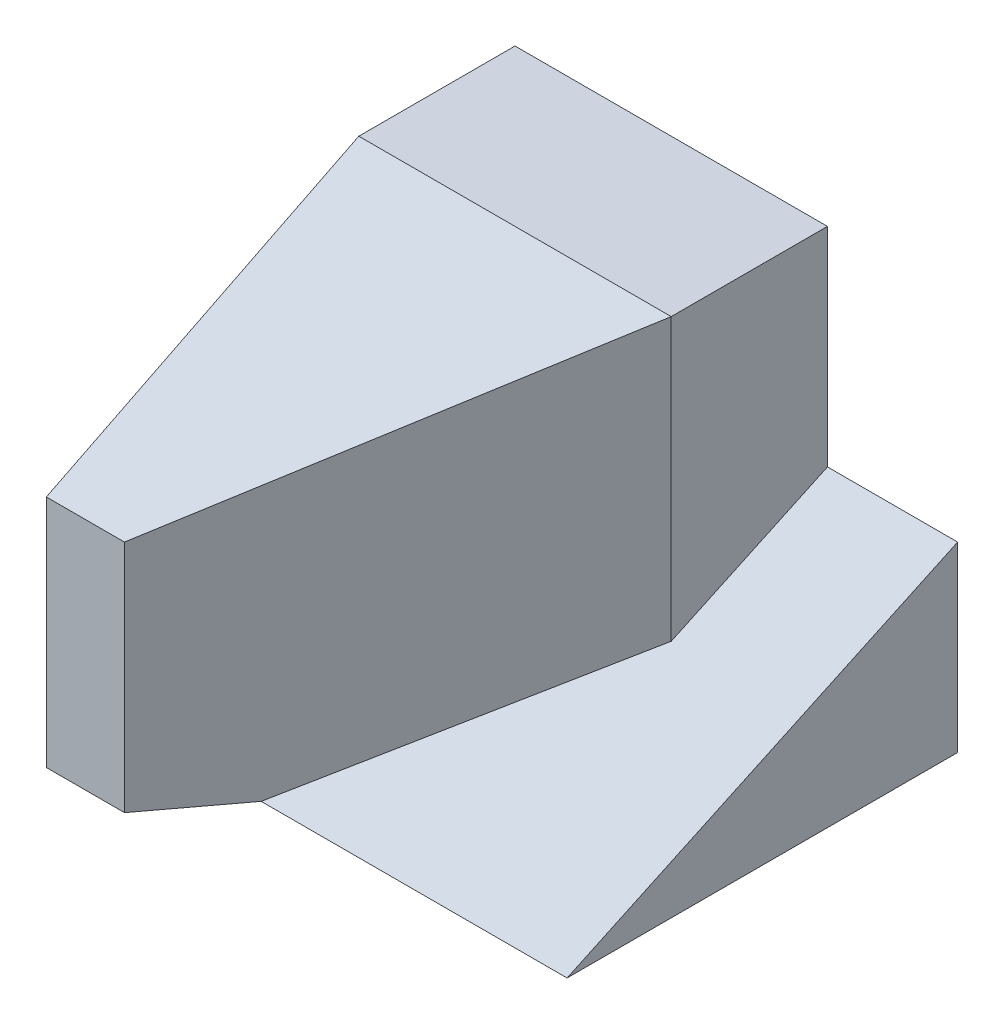
ISO-10303-21;
HEADER;
FILE_DESCRIPTION(('STEP AP214'),'2;1');
FILE_NAME('part.step','',(''),(''),'','','');
FILE_SCHEMA(('AUTOMOTIVE_DESIGN { 1 0 10303 214 1 1 1 1 }'));
ENDSEC;
DATA;
#1=APPLICATION_CONTEXT('core data for automotive mechanical design processes');
#2=APPLICATION_PROTOCOL_DEFINITION('international standard','automotive_design',2000,#1);
#3=PRODUCT_CONTEXT('',#1,'mechanical');
#4=PRODUCT('Part','Part','',(#3));
#5=PRODUCT_RELATED_PRODUCT_CATEGORY('part','',(#4));
#6=PRODUCT_DEFINITION_FORMATION('','',#4);
#7=PRODUCT_DEFINITION_CONTEXT('part definition',#1,'design');
#8=PRODUCT_DEFINITION('design','',#6,#7);
#9=PRODUCT_DEFINITION_SHAPE('','',#8);
#10=(LENGTH_UNIT() NAMED_UNIT(*) SI_UNIT(.MILLI.,.METRE.));
#11=(NAMED_UNIT(*) PLANE_ANGLE_UNIT() SI_UNIT($,.RADIAN.));
#12=(NAMED_UNIT(*) SI_UNIT($,.STERADIAN.) SOLID_ANGLE_UNIT());
#13=UNCERTAINTY_MEASURE_WITH_UNIT(LENGTH_MEASURE(1.E-05),#10,'distance_accuracy_value','');
#14=(GEOMETRIC_REPRESENTATION_CONTEXT(3) GLOBAL_UNCERTAINTY_ASSIGNED_CONTEXT((#13)) GLOBAL_UNIT_ASSIGNED_CONTEXT((#10,
#11,#12)) REPRESENTATION_CONTEXT('',''));
#15=CARTESIAN_POINT('',(0.,0.,0.));
#16=DIRECTION('',(0.,0.,1.));
#17=DIRECTION('',(1.,0.,0.));
#18=AXIS2_PLACEMENT_3D('',#15,#16,#17);
#19=CARTESIAN_POINT('',(0.,75.,0.));
#20=DIRECTION('',(1.,0.,0.));
#21=DIRECTION('',(0.,0.,-1.));
#22=AXIS2_PLACEMENT_3D('',#19,#20,#21);
#23=PLANE('',#22);
#24=DIRECTION('',(0.,-1.,0.));
#25=VECTOR('',#24,1.);
#26=CARTESIAN_POINT('',(0.,75.,0.));
#27=LINE('',#26,#25);
#28=CARTESIAN_POINT('',(0.,45.,0.));
#29=VERTEX_POINT('',#28);
#30=CARTESIAN_POINT('',(0.,0.,0.));
#31=VERTEX_POINT('',#30);
#32=EDGE_CURVE('E150',#29,#31,#27,.T.);
#33=ORIENTED_EDGE('',*,*,#32,.F.);
#34=DIRECTION('',(0.,0.447213595499958,-0.894427190999916));
#35=VECTOR('',#34,1.);
#36=CARTESIAN_POINT('',(0.,75.,-60.));
#37=LINE('',#36,#35);
#38=CARTESIAN_POINT('',(0.,75.,-60.));
#39=VERTEX_POINT('',#38);
#40=EDGE_CURVE('E121',#29,#39,#37,.T.);
#41=ORIENTED_EDGE('',*,*,#40,.T.);
#42=DIRECTION('',(0.,0.,1.));
#43=VECTOR('',#42,1.);
#44=CARTESIAN_POINT('',(0.,75.,0.));
#45=LINE('',#44,#43);
#46=CARTESIAN_POINT('',(0.,75.,-90.));
#47=VERTEX_POINT('',#46);
#48=EDGE_CURVE('E132',#47,#39,#45,.T.);
#49=ORIENTED_EDGE('',*,*,#48,.F.);
#50=DIRECTION('',(0.,-1.,0.));
#51=VECTOR('',#50,1.);
#52=CARTESIAN_POINT('',(0.,75.,-90.));
#53=LINE('',#52,#51);
#54=CARTESIAN_POINT('',(0.,0.,-90.));
#55=VERTEX_POINT('',#54);
#56=EDGE_CURVE('E140',#47,#55,#53,.T.);
#57=ORIENTED_EDGE('',*,*,#56,.T.);
#58=DIRECTION('',(0.,0.,1.));
#59=VECTOR('',#58,1.);
#60=CARTESIAN_POINT('',(0.,0.,0.));
#61=LINE('',#60,#59);
#62=EDGE_CURVE('E129',#55,#31,#61,.T.);
#63=ORIENTED_EDGE('',*,*,#62,.T.);
#64=EDGE_LOOP('',(#33,#41,#49,#57,#63));
#65=FACE_BOUND('',#64,.T.);
#66=ADVANCED_FACE('F31',(#65),#23,.F.);
#67=CARTESIAN_POINT('',(0.,75.,0.));
#68=DIRECTION('',(0.,0.,-1.));
#69=DIRECTION('',(-1.,0.,0.));
#70=AXIS2_PLACEMENT_3D('',#67,#68,#69);
#71=PLANE('',#70);
#72=DIRECTION('',(1.,0.,0.));
#73=VECTOR('',#72,1.);
#74=CARTESIAN_POINT('',(0.,0.,0.));
#75=LINE('',#74,#73);
#76=CARTESIAN_POINT('',(15.,0.,0.));
#77=VERTEX_POINT('',#76);
#78=EDGE_CURVE('E143',#31,#77,#75,.T.);
#79=ORIENTED_EDGE('',*,*,#78,.T.);
#80=DIRECTION('',(0.,1.,0.));
#81=VECTOR('',#80,1.);
#82=CARTESIAN_POINT('',(15.,0.,0.));
#83=LINE('',#82,#81);
#84=CARTESIAN_POINT('',(15.,45.,0.));
#85=VERTEX_POINT('',#84);
#86=EDGE_CURVE('E118',#77,#85,#83,.T.);
#87=ORIENTED_EDGE('',*,*,#86,.T.);
#88=DIRECTION('',(1.,0.,0.));
#89=VECTOR('',#88,1.);
#90=CARTESIAN_POINT('',(0.,45.,0.));
#91=LINE('',#90,#89);
#92=EDGE_CURVE('E125',#29,#85,#91,.T.);
#93=ORIENTED_EDGE('',*,*,#92,.F.);
#94=ORIENTED_EDGE('',*,*,#32,.T.);
#95=EDGE_LOOP('',(#79,#87,#93,#94));
#96=FACE_BOUND('',#95,.T.);
#97=ADVANCED_FACE('F166',(#96),#71,.F.);
#98=CARTESIAN_POINT('',(60.,75.,0.));
#99=DIRECTION('',(-1.,0.,0.));
#100=DIRECTION('',(0.,0.,1.));
#101=AXIS2_PLACEMENT_3D('',#98,#99,#100);
#102=PLANE('',#101);
#103=DIRECTION('',(0.,1.,0.));
#104=VECTOR('',#103,1.);
#105=CARTESIAN_POINT('',(60.,0.,-60.));
#106=LINE('',#105,#104);
#107=CARTESIAN_POINT('',(60.,21.,-60.));
#108=VERTEX_POINT('',#107);
#109=CARTESIAN_POINT('',(60.,75.,-60.));
#110=VERTEX_POINT('',#109);
#111=EDGE_CURVE('E51',#108,#110,#106,.T.);
#112=ORIENTED_EDGE('',*,*,#111,.F.);
#113=DIRECTION('',(0.,0.422885465331124,-0.906183139995265));
#114=VECTOR('',#113,1.);
#115=CARTESIAN_POINT('',(60.,7.66423357664234,-31.4233576642336));
#116=LINE('',#115,#114);
#117=CARTESIAN_POINT('',(60.,35.,-90.));
#118=VERTEX_POINT('',#117);
#119=EDGE_CURVE('E45',#108,#118,#116,.T.);
#120=ORIENTED_EDGE('',*,*,#119,.T.);
#121=DIRECTION('',(0.,-1.,0.));
#122=VECTOR('',#121,1.);
#123=CARTESIAN_POINT('',(60.,75.,-90.));
#124=LINE('',#123,#122);
#125=CARTESIAN_POINT('',(60.,75.,-90.));
#126=VERTEX_POINT('',#125);
#127=EDGE_CURVE('E98',#126,#118,#124,.T.);
#128=ORIENTED_EDGE('',*,*,#127,.F.);
#129=DIRECTION('',(0.,0.,-1.));
#130=VECTOR('',#129,1.);
#131=CARTESIAN_POINT('',(60.,75.,0.));
#132=LINE('',#131,#130);
#133=EDGE_CURVE('E135',#110,#126,#132,.T.);
#134=ORIENTED_EDGE('',*,*,#133,.F.);
#135=EDGE_LOOP('',(#112,#120,#128,#134));
#136=FACE_BOUND('',#135,.T.);
#137=ADVANCED_FACE('F160',(#136),#102,.F.);
#138=CARTESIAN_POINT('',(0.,75.,-90.));
#139=DIRECTION('',(0.,0.,1.));
#140=DIRECTION('',(1.,0.,0.));
#141=AXIS2_PLACEMENT_3D('',#138,#139,#140);
#142=PLANE('',#141);
#143=ORIENTED_EDGE('',*,*,#127,.T.);
#144=DIRECTION('',(1.,0.,0.));
#145=VECTOR('',#144,1.);
#146=CARTESIAN_POINT('',(5.,35.,-90.));
#147=LINE('',#146,#145);
#148=CARTESIAN_POINT('',(85.,35.,-90.));
#149=VERTEX_POINT('',#148);
#150=EDGE_CURVE('E91',#118,#149,#147,.T.);
#151=ORIENTED_EDGE('',*,*,#150,.T.);
#152=DIRECTION('',(0.,1.,0.));
#153=VECTOR('',#152,1.);
#154=CARTESIAN_POINT('',(85.,35.,-90.));
#155=LINE('',#154,#153);
#156=CARTESIAN_POINT('',(85.,0.,-90.));
#157=VERTEX_POINT('',#156);
#158=EDGE_CURVE('E95',#157,#149,#155,.T.);
#159=ORIENTED_EDGE('',*,*,#158,.F.);
#160=DIRECTION('',(-1.,0.,0.));
#161=VECTOR('',#160,1.);
#162=CARTESIAN_POINT('',(0.,0.,-90.));
#163=LINE('',#162,#161);
#164=EDGE_CURVE('E136',#157,#55,#163,.T.);
#165=ORIENTED_EDGE('',*,*,#164,.T.);
#166=ORIENTED_EDGE('',*,*,#56,.F.);
#167=DIRECTION('',(-1.,0.,0.));
#168=VECTOR('',#167,1.);
#169=CARTESIAN_POINT('',(0.,75.,-90.));
#170=LINE('',#169,#168);
#171=EDGE_CURVE('E138',#126,#47,#170,.T.);
#172=ORIENTED_EDGE('',*,*,#171,.F.);
#173=EDGE_LOOP('',(#143,#151,#159,#165,#166,#172));
#174=FACE_BOUND('',#173,.T.);
#175=ADVANCED_FACE('F93',(#174),#142,.F.);
#176=CARTESIAN_POINT('',(0.,75.,-90.));
#177=DIRECTION('',(0.,-1.,0.));
#178=DIRECTION('',(0.,0.,-1.));
#179=AXIS2_PLACEMENT_3D('',#176,#177,#178);
#180=PLANE('',#179);
#181=ORIENTED_EDGE('',*,*,#48,.T.);
#182=DIRECTION('',(1.,0.,0.));
#183=VECTOR('',#182,1.);
#184=CARTESIAN_POINT('',(0.,75.,-60.));
#185=LINE('',#184,#183);
#186=EDGE_CURVE('E126',#39,#110,#185,.T.);
#187=ORIENTED_EDGE('',*,*,#186,.T.);
#188=ORIENTED_EDGE('',*,*,#133,.T.);
#189=ORIENTED_EDGE('',*,*,#171,.T.);
#190=EDGE_LOOP('',(#181,#187,#188,#189));
#191=FACE_BOUND('',#190,.T.);
#192=ADVANCED_FACE('F157',(#191),#180,.F.);
#193=CARTESIAN_POINT('',(0.,0.,-90.));
#194=DIRECTION('',(0.,-1.,0.));
#195=DIRECTION('',(0.,0.,-1.));
#196=AXIS2_PLACEMENT_3D('',#193,#194,#195);
#197=PLANE('',#196);
#198=ORIENTED_EDGE('',*,*,#164,.F.);
#199=DIRECTION('',(0.,0.,-1.));
#200=VECTOR('',#199,1.);
#201=CARTESIAN_POINT('',(85.,0.,-90.));
#202=LINE('',#201,#200);
#203=CARTESIAN_POINT('',(85.,0.,-15.));
#204=VERTEX_POINT('',#203);
#205=EDGE_CURVE('E100',#204,#157,#202,.T.);
#206=ORIENTED_EDGE('',*,*,#205,.F.);
#207=DIRECTION('',(1.,0.,0.));
#208=VECTOR('',#207,1.);
#209=CARTESIAN_POINT('',(5.,0.,-15.));
#210=LINE('',#209,#208);
#211=CARTESIAN_POINT('',(26.25,0.,-15.));
#212=VERTEX_POINT('',#211);
#213=EDGE_CURVE('E99',#212,#204,#210,.T.);
#214=ORIENTED_EDGE('',*,*,#213,.F.);
#215=DIRECTION('',(-0.6,0.,0.8));
#216=VECTOR('',#215,1.);
#217=CARTESIAN_POINT('',(60.,0.,-60.));
#218=LINE('',#217,#216);
#219=EDGE_CURVE('E116',#212,#77,#218,.T.);
#220=ORIENTED_EDGE('',*,*,#219,.T.);
#221=ORIENTED_EDGE('',*,*,#78,.F.);
#222=ORIENTED_EDGE('',*,*,#62,.F.);
#223=EDGE_LOOP('',(#198,#206,#214,#220,#221,#222));
#224=FACE_BOUND('',#223,.T.);
#225=ADVANCED_FACE('F171',(#224),#197,.T.);
#226=CARTESIAN_POINT('',(0.,75.,-60.));
#227=DIRECTION('',(0.,-0.894427190999916,-0.447213595499958));
#228=DIRECTION('',(0.,0.447213595499958,-0.894427190999916));
#229=AXIS2_PLACEMENT_3D('',#226,#227,#228);
#230=PLANE('',#229);
#231=ORIENTED_EDGE('',*,*,#92,.T.);
#232=DIRECTION('',(0.557086014531155,0.371390676354104,-0.742781352708207));
#233=VECTOR('',#232,1.);
#234=CARTESIAN_POINT('',(41.3793103448276,62.5862068965517,-35.1724137931034));
#235=LINE('',#234,#233);
#236=EDGE_CURVE('E38',#85,#110,#235,.T.);
#237=ORIENTED_EDGE('',*,*,#236,.T.);
#238=ORIENTED_EDGE('',*,*,#186,.F.);
#239=ORIENTED_EDGE('',*,*,#40,.F.);
#240=EDGE_LOOP('',(#231,#237,#238,#239));
#241=FACE_BOUND('',#240,.T.);
#242=ADVANCED_FACE('F152',(#241),#230,.F.);
#243=CARTESIAN_POINT('',(60.,0.,-60.));
#244=DIRECTION('',(-0.8,0.,-0.6));
#245=DIRECTION('',(-0.6,0.,0.8));
#246=AXIS2_PLACEMENT_3D('',#243,#244,#245);
#247=PLANE('',#246);
#248=ORIENTED_EDGE('',*,*,#219,.F.);
#249=DIRECTION('',(0.562104908836414,0.349754165498213,-0.749473211781886));
#250=VECTOR('',#249,1.);
#251=CARTESIAN_POINT('',(55.8714308004369,18.4311124980496,-54.4952410672492));
#252=LINE('',#251,#250);
#253=EDGE_CURVE('E11',#212,#108,#252,.T.);
#254=ORIENTED_EDGE('',*,*,#253,.T.);
#255=ORIENTED_EDGE('',*,*,#111,.T.);
#256=ORIENTED_EDGE('',*,*,#236,.F.);
#257=ORIENTED_EDGE('',*,*,#86,.F.);
#258=EDGE_LOOP('',(#248,#254,#255,#256,#257));
#259=FACE_BOUND('',#258,.T.);
#260=ADVANCED_FACE('F169',(#259),#247,.F.);
#261=CARTESIAN_POINT('',(5.,0.,-15.));
#262=DIRECTION('',(0.,0.906183139995265,0.422885465331124));
#263=DIRECTION('',(0.,-0.422885465331124,0.906183139995265));
#264=AXIS2_PLACEMENT_3D('',#261,#262,#263);
#265=PLANE('',#264);
#266=ORIENTED_EDGE('',*,*,#119,.F.);
#267=ORIENTED_EDGE('',*,*,#253,.F.);
#268=ORIENTED_EDGE('',*,*,#213,.T.);
#269=DIRECTION('',(0.,-0.422885465331124,0.906183139995265));
#270=VECTOR('',#269,1.);
#271=CARTESIAN_POINT('',(85.,0.,-15.));
#272=LINE('',#271,#270);
#273=EDGE_CURVE('E103',#149,#204,#272,.T.);
#274=ORIENTED_EDGE('',*,*,#273,.F.);
#275=ORIENTED_EDGE('',*,*,#150,.F.);
#276=EDGE_LOOP('',(#266,#267,#268,#274,#275));
#277=FACE_BOUND('',#276,.T.);
#278=ADVANCED_FACE('F104',(#277),#265,.T.);
#279=CARTESIAN_POINT('',(85.,0.,-90.));
#280=DIRECTION('',(-1.,0.,0.));
#281=DIRECTION('',(0.,0.,1.));
#282=AXIS2_PLACEMENT_3D('',#279,#280,#281);
#283=PLANE('',#282);
#284=ORIENTED_EDGE('',*,*,#158,.T.);
#285=ORIENTED_EDGE('',*,*,#273,.T.);
#286=ORIENTED_EDGE('',*,*,#205,.T.);
#287=EDGE_LOOP('',(#284,#285,#286));
#288=FACE_BOUND('',#287,.T.);
#289=ADVANCED_FACE('F110',(#288),#283,.F.);
#290=CLOSED_SHELL('',(#66,#97,#137,#175,#192,#225,#242,#260,#278,#289));
#291=MANIFOLD_SOLID_BREP('B2',#290);
#292=ADVANCED_BREP_SHAPE_REPRESENTATION('',(#18,#291),#14);
#293=SHAPE_DEFINITION_REPRESENTATION(#9,#292);
ENDSEC;
END-ISO-10303-21;
